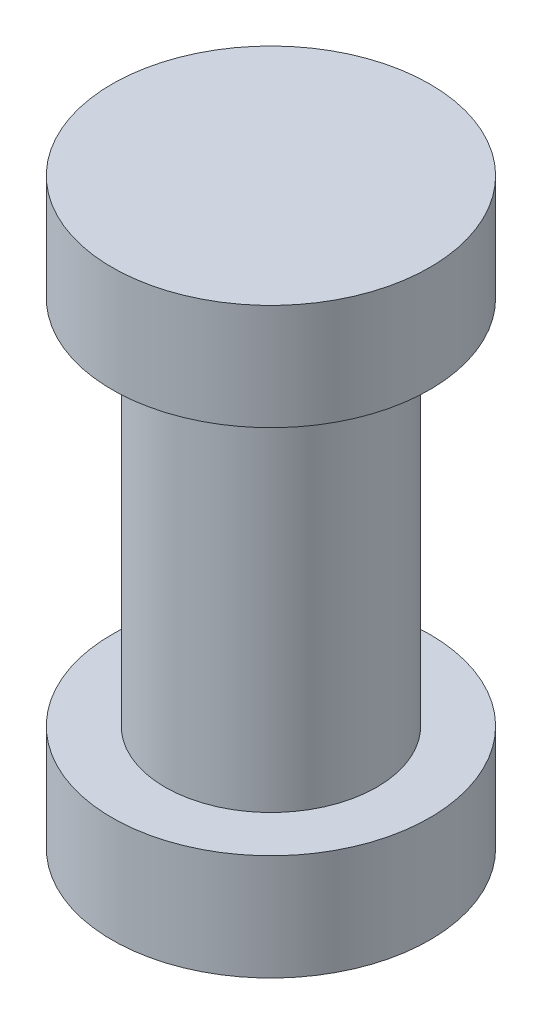
ISO-10303-21;
HEADER;
FILE_DESCRIPTION(('STEP AP214'),'2;1');
FILE_NAME('part.step','',(''),(''),'','','');
FILE_SCHEMA(('AUTOMOTIVE_DESIGN { 1 0 10303 214 1 1 1 1 }'));
ENDSEC;
DATA;
#1=APPLICATION_CONTEXT('core data for automotive mechanical design processes');
#2=APPLICATION_PROTOCOL_DEFINITION('international standard','automotive_design',2000,#1);
#3=PRODUCT_CONTEXT('',#1,'mechanical');
#4=PRODUCT('Part','Part','',(#3));
#5=PRODUCT_RELATED_PRODUCT_CATEGORY('part','',(#4));
#6=PRODUCT_DEFINITION_FORMATION('','',#4);
#7=PRODUCT_DEFINITION_CONTEXT('part definition',#1,'design');
#8=PRODUCT_DEFINITION('design','',#6,#7);
#9=PRODUCT_DEFINITION_SHAPE('','',#8);
#10=(LENGTH_UNIT() NAMED_UNIT(*) SI_UNIT(.MILLI.,.METRE.));
#11=(NAMED_UNIT(*) PLANE_ANGLE_UNIT() SI_UNIT($,.RADIAN.));
#12=(NAMED_UNIT(*) SI_UNIT($,.STERADIAN.) SOLID_ANGLE_UNIT());
#13=UNCERTAINTY_MEASURE_WITH_UNIT(LENGTH_MEASURE(1.E-05),#10,'distance_accuracy_value','');
#14=(GEOMETRIC_REPRESENTATION_CONTEXT(3) GLOBAL_UNCERTAINTY_ASSIGNED_CONTEXT((#13)) GLOBAL_UNIT_ASSIGNED_CONTEXT((#10,
#11,#12)) REPRESENTATION_CONTEXT('',''));
#15=CARTESIAN_POINT('',(0.,0.,0.));
#16=DIRECTION('',(0.,0.,1.));
#17=DIRECTION('',(1.,0.,0.));
#18=AXIS2_PLACEMENT_3D('',#15,#16,#17);
#19=CARTESIAN_POINT('',(0.,2.65178571428571,0.));
#20=DIRECTION('',(0.,1.,0.));
#21=DIRECTION('',(0.,0.,1.));
#22=AXIS2_PLACEMENT_3D('',#19,#20,#21);
#23=PLANE('',#22);
#24=CARTESIAN_POINT('',(0.,2.65178571428571,0.));
#25=DIRECTION('',(0.,-1.,0.));
#26=DIRECTION('',(0.,0.,-1.));
#27=AXIS2_PLACEMENT_3D('',#24,#25,#26);
#28=CIRCLE('',#27,1.5);
#29=CARTESIAN_POINT('',(0.,2.65178571428571,-1.5));
#30=VERTEX_POINT('',#29);
#31=EDGE_CURVE('E10',#30,#30,#28,.T.);
#32=ORIENTED_EDGE('',*,*,#31,.F.);
#33=EDGE_LOOP('',(#32));
#34=FACE_BOUND('',#33,.T.);
#35=ADVANCED_FACE('F41',(#34),#23,.T.);
#36=CARTESIAN_POINT('',(0.,-2.84821428571429,0.));
#37=DIRECTION('',(0.,-1.,0.));
#38=DIRECTION('',(0.,0.,-1.));
#39=AXIS2_PLACEMENT_3D('',#36,#37,#38);
#40=CYLINDRICAL_SURFACE('',#39,1.5);
#41=ORIENTED_EDGE('',*,*,#31,.T.);
#42=EDGE_LOOP('',(#41));
#43=FACE_BOUND('',#42,.T.);
#44=CARTESIAN_POINT('',(0.,1.65178571428571,0.));
#45=DIRECTION('',(0.,-1.,0.));
#46=DIRECTION('',(0.,0.,-1.));
#47=AXIS2_PLACEMENT_3D('',#44,#45,#46);
#48=CIRCLE('',#47,1.5);
#49=CARTESIAN_POINT('',(0.,1.65178571428571,-1.5));
#50=VERTEX_POINT('',#49);
#51=EDGE_CURVE('E48',#50,#50,#48,.T.);
#52=ORIENTED_EDGE('',*,*,#51,.F.);
#53=EDGE_LOOP('',(#52));
#54=FACE_BOUND('',#53,.T.);
#55=ADVANCED_FACE('F89',(#43,#54),#40,.T.);
#56=CARTESIAN_POINT('',(1.5,1.65178571428571,0.));
#57=DIRECTION('',(0.,-1.,0.));
#58=DIRECTION('',(0.,0.,-1.));
#59=AXIS2_PLACEMENT_3D('',#56,#57,#58);
#60=PLANE('',#59);
#61=ORIENTED_EDGE('',*,*,#51,.T.);
#62=EDGE_LOOP('',(#61));
#63=FACE_BOUND('',#62,.T.);
#64=CARTESIAN_POINT('',(0.,1.65178571428571,0.));
#65=DIRECTION('',(0.,-1.,0.));
#66=DIRECTION('',(0.,0.,-1.));
#67=AXIS2_PLACEMENT_3D('',#64,#65,#66);
#68=CIRCLE('',#67,1.);
#69=CARTESIAN_POINT('',(0.,1.65178571428571,-1.));
#70=VERTEX_POINT('',#69);
#71=EDGE_CURVE('E53',#70,#70,#68,.T.);
#72=ORIENTED_EDGE('',*,*,#71,.F.);
#73=EDGE_LOOP('',(#72));
#74=FACE_BOUND('',#73,.T.);
#75=ADVANCED_FACE('F94',(#63,#74),#60,.T.);
#76=CARTESIAN_POINT('',(0.,-2.84821428571429,0.));
#77=DIRECTION('',(0.,-1.,0.));
#78=DIRECTION('',(0.,0.,-1.));
#79=AXIS2_PLACEMENT_3D('',#76,#77,#78);
#80=CYLINDRICAL_SURFACE('',#79,1.);
#81=ORIENTED_EDGE('',*,*,#71,.T.);
#82=EDGE_LOOP('',(#81));
#83=FACE_BOUND('',#82,.T.);
#84=CARTESIAN_POINT('',(0.,-1.84821428571429,0.));
#85=DIRECTION('',(0.,-1.,0.));
#86=DIRECTION('',(0.,0.,-1.));
#87=AXIS2_PLACEMENT_3D('',#84,#85,#86);
#88=CIRCLE('',#87,1.);
#89=CARTESIAN_POINT('',(0.,-1.84821428571429,-1.));
#90=VERTEX_POINT('',#89);
#91=EDGE_CURVE('E58',#90,#90,#88,.T.);
#92=ORIENTED_EDGE('',*,*,#91,.F.);
#93=EDGE_LOOP('',(#92));
#94=FACE_BOUND('',#93,.T.);
#95=ADVANCED_FACE('F85',(#83,#94),#80,.T.);
#96=CARTESIAN_POINT('',(1.,-1.84821428571429,0.));
#97=DIRECTION('',(0.,1.,0.));
#98=DIRECTION('',(0.,0.,1.));
#99=AXIS2_PLACEMENT_3D('',#96,#97,#98);
#100=PLANE('',#99);
#101=ORIENTED_EDGE('',*,*,#91,.T.);
#102=EDGE_LOOP('',(#101));
#103=FACE_BOUND('',#102,.T.);
#104=CARTESIAN_POINT('',(0.,-1.84821428571429,0.));
#105=DIRECTION('',(0.,-1.,0.));
#106=DIRECTION('',(0.,0.,-1.));
#107=AXIS2_PLACEMENT_3D('',#104,#105,#106);
#108=CIRCLE('',#107,1.5);
#109=CARTESIAN_POINT('',(0.,-1.84821428571429,-1.5));
#110=VERTEX_POINT('',#109);
#111=EDGE_CURVE('E64',#110,#110,#108,.T.);
#112=ORIENTED_EDGE('',*,*,#111,.F.);
#113=EDGE_LOOP('',(#112));
#114=FACE_BOUND('',#113,.T.);
#115=ADVANCED_FACE('F77',(#103,#114),#100,.T.);
#116=CARTESIAN_POINT('',(0.,-2.84821428571429,0.));
#117=DIRECTION('',(0.,-1.,0.));
#118=DIRECTION('',(0.,0.,-1.));
#119=AXIS2_PLACEMENT_3D('',#116,#117,#118);
#120=CYLINDRICAL_SURFACE('',#119,1.5);
#121=ORIENTED_EDGE('',*,*,#111,.T.);
#122=EDGE_LOOP('',(#121));
#123=FACE_BOUND('',#122,.T.);
#124=CARTESIAN_POINT('',(0.,-2.84821428571429,0.));
#125=DIRECTION('',(0.,-1.,0.));
#126=DIRECTION('',(0.,0.,-1.));
#127=AXIS2_PLACEMENT_3D('',#124,#125,#126);
#128=CIRCLE('',#127,1.5);
#129=CARTESIAN_POINT('',(0.,-2.84821428571429,-1.5));
#130=VERTEX_POINT('',#129);
#131=EDGE_CURVE('E68',#130,#130,#128,.T.);
#132=ORIENTED_EDGE('',*,*,#131,.F.);
#133=EDGE_LOOP('',(#132));
#134=FACE_BOUND('',#133,.T.);
#135=ADVANCED_FACE('F75',(#123,#134),#120,.T.);
#136=CARTESIAN_POINT('',(1.5,-2.84821428571429,0.));
#137=DIRECTION('',(0.,-1.,0.));
#138=DIRECTION('',(0.,0.,-1.));
#139=AXIS2_PLACEMENT_3D('',#136,#137,#138);
#140=PLANE('',#139);
#141=ORIENTED_EDGE('',*,*,#131,.T.);
#142=EDGE_LOOP('',(#141));
#143=FACE_BOUND('',#142,.T.);
#144=ADVANCED_FACE('F73',(#143),#140,.T.);
#145=CLOSED_SHELL('',(#35,#55,#75,#95,#115,#135,#144));
#146=MANIFOLD_SOLID_BREP('B2',#145);
#147=ADVANCED_BREP_SHAPE_REPRESENTATION('',(#18,#146),#14);
#148=SHAPE_DEFINITION_REPRESENTATION(#9,#147);
ENDSEC;
END-ISO-10303-21;
